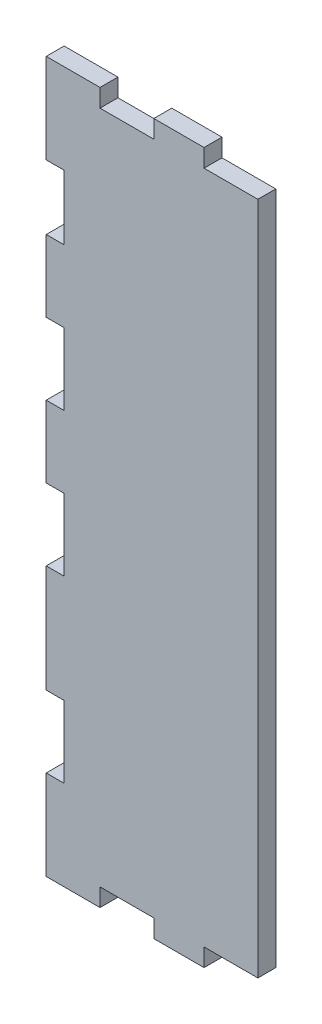
ISO-10303-21;
HEADER;
FILE_DESCRIPTION(('STEP AP214'),'2;1');
FILE_NAME('part.step','',(''),(''),'','','');
FILE_SCHEMA(('AUTOMOTIVE_DESIGN { 1 0 10303 214 1 1 1 1 }'));
ENDSEC;
DATA;
#1=APPLICATION_CONTEXT('core data for automotive mechanical design processes');
#2=APPLICATION_PROTOCOL_DEFINITION('international standard','automotive_design',2000,#1);
#3=PRODUCT_CONTEXT('',#1,'mechanical');
#4=PRODUCT('Part','Part','',(#3));
#5=PRODUCT_RELATED_PRODUCT_CATEGORY('part','',(#4));
#6=PRODUCT_DEFINITION_FORMATION('','',#4);
#7=PRODUCT_DEFINITION_CONTEXT('part definition',#1,'design');
#8=PRODUCT_DEFINITION('design','',#6,#7);
#9=PRODUCT_DEFINITION_SHAPE('','',#8);
#10=(LENGTH_UNIT() NAMED_UNIT(*) SI_UNIT(.MILLI.,.METRE.));
#11=(NAMED_UNIT(*) PLANE_ANGLE_UNIT() SI_UNIT($,.RADIAN.));
#12=(NAMED_UNIT(*) SI_UNIT($,.STERADIAN.) SOLID_ANGLE_UNIT());
#13=UNCERTAINTY_MEASURE_WITH_UNIT(LENGTH_MEASURE(1.E-05),#10,'distance_accuracy_value','');
#14=(GEOMETRIC_REPRESENTATION_CONTEXT(3) GLOBAL_UNCERTAINTY_ASSIGNED_CONTEXT((#13)) GLOBAL_UNIT_ASSIGNED_CONTEXT((#10,
#11,#12)) REPRESENTATION_CONTEXT('',''));
#15=CARTESIAN_POINT('',(0.,0.,0.));
#16=DIRECTION('',(0.,0.,1.));
#17=DIRECTION('',(1.,0.,0.));
#18=AXIS2_PLACEMENT_3D('',#15,#16,#17);
#19=CARTESIAN_POINT('',(-74.93,1.26999999999999,6.35));
#20=DIRECTION('',(1.,0.,0.));
#21=DIRECTION('',(0.,0.,-1.));
#22=AXIS2_PLACEMENT_3D('',#19,#20,#21);
#23=PLANE('',#22);
#24=DIRECTION('',(0.,1.,0.));
#25=VECTOR('',#24,1.);
#26=CARTESIAN_POINT('',(-74.93,1.26999999999999,0.));
#27=LINE('',#26,#25);
#28=CARTESIAN_POINT('',(-74.93,58.42,0.));
#29=VERTEX_POINT('',#28);
#30=CARTESIAN_POINT('',(-74.93,96.52,0.));
#31=VERTEX_POINT('',#30);
#32=EDGE_CURVE('E411',#29,#31,#27,.T.);
#33=ORIENTED_EDGE('',*,*,#32,.F.);
#34=DIRECTION('',(0.,0.,1.));
#35=VECTOR('',#34,1.);
#36=CARTESIAN_POINT('',(-74.93,58.42,0.));
#37=LINE('',#36,#35);
#38=CARTESIAN_POINT('',(-74.93,58.42,6.35));
#39=VERTEX_POINT('',#38);
#40=EDGE_CURVE('E281',#29,#39,#37,.T.);
#41=ORIENTED_EDGE('',*,*,#40,.T.);
#42=DIRECTION('',(0.,1.,0.));
#43=VECTOR('',#42,1.);
#44=CARTESIAN_POINT('',(-74.93,1.26999999999999,6.35));
#45=LINE('',#44,#43);
#46=CARTESIAN_POINT('',(-74.93,96.52,6.35));
#47=VERTEX_POINT('',#46);
#48=EDGE_CURVE('E416',#39,#47,#45,.T.);
#49=ORIENTED_EDGE('',*,*,#48,.T.);
#50=DIRECTION('',(0.,0.,1.));
#51=VECTOR('',#50,1.);
#52=CARTESIAN_POINT('',(-74.93,96.52,0.));
#53=LINE('',#52,#51);
#54=EDGE_CURVE('E287',#31,#47,#53,.T.);
#55=ORIENTED_EDGE('',*,*,#54,.F.);
#56=EDGE_LOOP('',(#33,#41,#49,#55));
#57=FACE_BOUND('',#56,.T.);
#58=ADVANCED_FACE('F36',(#57),#23,.F.);
#59=CARTESIAN_POINT('',(-74.93,121.92,0.));
#60=VERTEX_POINT('',#59);
#61=CARTESIAN_POINT('',(-74.93,147.32,0.));
#62=VERTEX_POINT('',#61);
#63=EDGE_CURVE('E537',#60,#62,#27,.T.);
#64=ORIENTED_EDGE('',*,*,#63,.F.);
#65=DIRECTION('',(0.,0.,1.));
#66=VECTOR('',#65,1.);
#67=CARTESIAN_POINT('',(-74.93,121.92,0.));
#68=LINE('',#67,#66);
#69=CARTESIAN_POINT('',(-74.93,121.92,6.35));
#70=VERTEX_POINT('',#69);
#71=EDGE_CURVE('E294',#60,#70,#68,.T.);
#72=ORIENTED_EDGE('',*,*,#71,.T.);
#73=CARTESIAN_POINT('',(-74.93,147.32,6.35));
#74=VERTEX_POINT('',#73);
#75=EDGE_CURVE('E559',#70,#74,#45,.T.);
#76=ORIENTED_EDGE('',*,*,#75,.T.);
#77=DIRECTION('',(0.,0.,1.));
#78=VECTOR('',#77,1.);
#79=CARTESIAN_POINT('',(-74.93,147.32,0.));
#80=LINE('',#79,#78);
#81=EDGE_CURVE('E313',#62,#74,#80,.T.);
#82=ORIENTED_EDGE('',*,*,#81,.F.);
#83=EDGE_LOOP('',(#64,#72,#76,#82));
#84=FACE_BOUND('',#83,.T.);
#85=ADVANCED_FACE('F521',(#84),#23,.F.);
#86=CARTESIAN_POINT('',(-74.93,172.72,0.));
#87=VERTEX_POINT('',#86);
#88=CARTESIAN_POINT('',(-74.93,198.12,0.));
#89=VERTEX_POINT('',#88);
#90=EDGE_CURVE('E535',#87,#89,#27,.T.);
#91=ORIENTED_EDGE('',*,*,#90,.F.);
#92=DIRECTION('',(0.,0.,1.));
#93=VECTOR('',#92,1.);
#94=CARTESIAN_POINT('',(-74.93,172.72,0.));
#95=LINE('',#94,#93);
#96=CARTESIAN_POINT('',(-74.93,172.72,6.35));
#97=VERTEX_POINT('',#96);
#98=EDGE_CURVE('E320',#87,#97,#95,.T.);
#99=ORIENTED_EDGE('',*,*,#98,.T.);
#100=CARTESIAN_POINT('',(-74.93,198.12,6.35));
#101=VERTEX_POINT('',#100);
#102=EDGE_CURVE('E571',#97,#101,#45,.T.);
#103=ORIENTED_EDGE('',*,*,#102,.T.);
#104=DIRECTION('',(0.,0.,1.));
#105=VECTOR('',#104,1.);
#106=CARTESIAN_POINT('',(-74.93,198.12,0.));
#107=LINE('',#106,#105);
#108=EDGE_CURVE('E337',#89,#101,#107,.T.);
#109=ORIENTED_EDGE('',*,*,#108,.F.);
#110=EDGE_LOOP('',(#91,#99,#103,#109));
#111=FACE_BOUND('',#110,.T.);
#112=ADVANCED_FACE('F525',(#111),#23,.F.);
#113=CARTESIAN_POINT('',(-74.93,220.98,0.));
#114=VERTEX_POINT('',#113);
#115=CARTESIAN_POINT('',(-74.93,252.73,0.));
#116=VERTEX_POINT('',#115);
#117=EDGE_CURVE('E412',#114,#116,#27,.T.);
#118=ORIENTED_EDGE('',*,*,#117,.F.);
#119=DIRECTION('',(0.,0.,1.));
#120=VECTOR('',#119,1.);
#121=CARTESIAN_POINT('',(-74.93,220.98,0.));
#122=LINE('',#121,#120);
#123=CARTESIAN_POINT('',(-74.93,220.98,6.35));
#124=VERTEX_POINT('',#123);
#125=EDGE_CURVE('E344',#114,#124,#122,.T.);
#126=ORIENTED_EDGE('',*,*,#125,.T.);
#127=CARTESIAN_POINT('',(-74.93,252.73,6.35));
#128=VERTEX_POINT('',#127);
#129=EDGE_CURVE('E406',#124,#128,#45,.T.);
#130=ORIENTED_EDGE('',*,*,#129,.T.);
#131=DIRECTION('',(0.,0.,-1.));
#132=VECTOR('',#131,1.);
#133=CARTESIAN_POINT('',(-74.93,252.73,6.35));
#134=LINE('',#133,#132);
#135=EDGE_CURVE('E380',#128,#116,#134,.T.);
#136=ORIENTED_EDGE('',*,*,#135,.T.);
#137=EDGE_LOOP('',(#118,#126,#130,#136));
#138=FACE_BOUND('',#137,.T.);
#139=ADVANCED_FACE('F508',(#138),#23,.F.);
#140=CARTESIAN_POINT('',(0.,1.27000000000005,6.35));
#141=DIRECTION('',(0.,1.,0.));
#142=DIRECTION('',(0.,0.,1.));
#143=AXIS2_PLACEMENT_3D('',#140,#141,#142);
#144=PLANE('',#143);
#145=DIRECTION('',(1.,0.,0.));
#146=VECTOR('',#145,1.);
#147=CARTESIAN_POINT('',(-76.2,1.27,6.35));
#148=LINE('',#147,#146);
#149=CARTESIAN_POINT('',(-36.83,1.27000000000005,6.35));
#150=VERTEX_POINT('',#149);
#151=CARTESIAN_POINT('',(-19.05,1.27000000000042,6.35));
#152=VERTEX_POINT('',#151);
#153=EDGE_CURVE('E45',#150,#152,#148,.T.);
#154=ORIENTED_EDGE('',*,*,#153,.F.);
#155=DIRECTION('',(0.,0.,1.));
#156=VECTOR('',#155,1.);
#157=CARTESIAN_POINT('',(-36.83,1.27000000000005,6.35));
#158=LINE('',#157,#156);
#159=CARTESIAN_POINT('',(-36.83,1.27000000000005,0.));
#160=VERTEX_POINT('',#159);
#161=EDGE_CURVE('E374',#160,#150,#158,.T.);
#162=ORIENTED_EDGE('',*,*,#161,.F.);
#163=DIRECTION('',(1.,0.,0.));
#164=VECTOR('',#163,1.);
#165=CARTESIAN_POINT('',(0.,1.27000000000005,0.));
#166=LINE('',#165,#164);
#167=CARTESIAN_POINT('',(-19.05,1.27000000000005,0.));
#168=VERTEX_POINT('',#167);
#169=EDGE_CURVE('E476',#160,#168,#166,.T.);
#170=ORIENTED_EDGE('',*,*,#169,.T.);
#171=DIRECTION('',(0.,0.,-1.));
#172=VECTOR('',#171,1.);
#173=CARTESIAN_POINT('',(-19.05,1.27000000000005,6.35));
#174=LINE('',#173,#172);
#175=EDGE_CURVE('E376',#152,#168,#174,.T.);
#176=ORIENTED_EDGE('',*,*,#175,.F.);
#177=EDGE_LOOP('',(#154,#162,#170,#176));
#178=FACE_BOUND('',#177,.T.);
#179=ADVANCED_FACE('F524',(#178),#144,.F.);
#180=CARTESIAN_POINT('',(0.,1.27000000000005,6.35));
#181=DIRECTION('',(-1.,0.,0.));
#182=DIRECTION('',(0.,0.,1.));
#183=AXIS2_PLACEMENT_3D('',#180,#181,#182);
#184=PLANE('',#183);
#185=DIRECTION('',(0.,1.,0.));
#186=VECTOR('',#185,1.);
#187=CARTESIAN_POINT('',(0.,1.27000000000005,6.35));
#188=LINE('',#187,#186);
#189=CARTESIAN_POINT('',(0.,7.62000000000005,6.35));
#190=VERTEX_POINT('',#189);
#191=CARTESIAN_POINT('',(0.,246.38,6.35));
#192=VERTEX_POINT('',#191);
#193=EDGE_CURVE('E462',#190,#192,#188,.T.);
#194=ORIENTED_EDGE('',*,*,#193,.F.);
#195=DIRECTION('',(0.,0.,1.));
#196=VECTOR('',#195,1.);
#197=CARTESIAN_POINT('',(0.,7.62000000000005,6.35));
#198=LINE('',#197,#196);
#199=CARTESIAN_POINT('',(0.,7.62000000000005,0.));
#200=VERTEX_POINT('',#199);
#201=EDGE_CURVE('E394',#200,#190,#198,.T.);
#202=ORIENTED_EDGE('',*,*,#201,.F.);
#203=DIRECTION('',(0.,1.,0.));
#204=VECTOR('',#203,1.);
#205=CARTESIAN_POINT('',(0.,1.27000000000005,0.));
#206=LINE('',#205,#204);
#207=CARTESIAN_POINT('',(0.,246.38,0.));
#208=VERTEX_POINT('',#207);
#209=EDGE_CURVE('E437',#200,#208,#206,.T.);
#210=ORIENTED_EDGE('',*,*,#209,.T.);
#211=DIRECTION('',(0.,0.,-1.));
#212=VECTOR('',#211,1.);
#213=CARTESIAN_POINT('',(0.,246.38,0.));
#214=LINE('',#213,#212);
#215=EDGE_CURVE('E454',#192,#208,#214,.T.);
#216=ORIENTED_EDGE('',*,*,#215,.F.);
#217=EDGE_LOOP('',(#194,#202,#210,#216));
#218=FACE_BOUND('',#217,.T.);
#219=ADVANCED_FACE('F38',(#218),#184,.F.);
#220=CARTESIAN_POINT('',(-76.2,252.73,6.35));
#221=DIRECTION('',(0.,-1.,0.));
#222=DIRECTION('',(0.,0.,-1.));
#223=AXIS2_PLACEMENT_3D('',#220,#221,#222);
#224=PLANE('',#223);
#225=DIRECTION('',(0.,0.,1.));
#226=VECTOR('',#225,1.);
#227=CARTESIAN_POINT('',(-36.83,252.73,0.));
#228=LINE('',#227,#226);
#229=CARTESIAN_POINT('',(-36.83,252.73,0.));
#230=VERTEX_POINT('',#229);
#231=CARTESIAN_POINT('',(-36.83,252.73,6.35));
#232=VERTEX_POINT('',#231);
#233=EDGE_CURVE('E430',#230,#232,#228,.T.);
#234=ORIENTED_EDGE('',*,*,#233,.T.);
#235=DIRECTION('',(-1.,0.,0.));
#236=VECTOR('',#235,1.);
#237=CARTESIAN_POINT('',(0.,252.73,6.35));
#238=LINE('',#237,#236);
#239=CARTESIAN_POINT('',(-19.05,252.73,6.35));
#240=VERTEX_POINT('',#239);
#241=EDGE_CURVE('E466',#240,#232,#238,.T.);
#242=ORIENTED_EDGE('',*,*,#241,.F.);
#243=DIRECTION('',(0.,0.,1.));
#244=VECTOR('',#243,1.);
#245=CARTESIAN_POINT('',(-19.05,252.73,0.));
#246=LINE('',#245,#244);
#247=CARTESIAN_POINT('',(-19.05,252.73,0.));
#248=VERTEX_POINT('',#247);
#249=EDGE_CURVE('E410',#248,#240,#246,.T.);
#250=ORIENTED_EDGE('',*,*,#249,.F.);
#251=DIRECTION('',(-1.,0.,0.));
#252=VECTOR('',#251,1.);
#253=CARTESIAN_POINT('',(-76.2,252.73,0.));
#254=LINE('',#253,#252);
#255=EDGE_CURVE('E470',#248,#230,#254,.T.);
#256=ORIENTED_EDGE('',*,*,#255,.T.);
#257=EDGE_LOOP('',(#234,#242,#250,#256));
#258=FACE_BOUND('',#257,.T.);
#259=ADVANCED_FACE('F618',(#258),#224,.F.);
#260=CARTESIAN_POINT('',(0.,0.,6.35));
#261=DIRECTION('',(0.,0.,1.));
#262=DIRECTION('',(1.,0.,0.));
#263=AXIS2_PLACEMENT_3D('',#260,#261,#262);
#264=PLANE('',#263);
#265=DIRECTION('',(-1.,0.,0.));
#266=VECTOR('',#265,1.);
#267=CARTESIAN_POINT('',(-74.93,58.42,6.35));
#268=LINE('',#267,#266);
#269=CARTESIAN_POINT('',(-68.58,58.42,6.35));
#270=VERTEX_POINT('',#269);
#271=EDGE_CURVE('E272',#270,#39,#268,.T.);
#272=ORIENTED_EDGE('',*,*,#271,.F.);
#273=DIRECTION('',(0.,1.,0.));
#274=VECTOR('',#273,1.);
#275=CARTESIAN_POINT('',(-68.58,33.02,6.35));
#276=LINE('',#275,#274);
#277=CARTESIAN_POINT('',(-68.58,33.02,6.35));
#278=VERTEX_POINT('',#277);
#279=EDGE_CURVE('E274',#278,#270,#276,.T.);
#280=ORIENTED_EDGE('',*,*,#279,.F.);
#281=DIRECTION('',(1.,0.,0.));
#282=VECTOR('',#281,1.);
#283=CARTESIAN_POINT('',(-74.93,33.02,6.35));
#284=LINE('',#283,#282);
#285=CARTESIAN_POINT('',(-74.93,33.02,6.35));
#286=VERTEX_POINT('',#285);
#287=EDGE_CURVE('E253',#286,#278,#284,.T.);
#288=ORIENTED_EDGE('',*,*,#287,.F.);
#289=CARTESIAN_POINT('',(-74.93,1.26999999999999,6.35));
#290=VERTEX_POINT('',#289);
#291=EDGE_CURVE('E413',#290,#286,#45,.T.);
#292=ORIENTED_EDGE('',*,*,#291,.F.);
#293=CARTESIAN_POINT('',(-55.88,1.27000000000015,6.35));
#294=VERTEX_POINT('',#293);
#295=EDGE_CURVE('E11',#290,#294,#148,.T.);
#296=ORIENTED_EDGE('',*,*,#295,.T.);
#297=DIRECTION('',(0.,-1.,0.));
#298=VECTOR('',#297,1.);
#299=CARTESIAN_POINT('',(-55.88,7.62000000000005,6.35));
#300=LINE('',#299,#298);
#301=CARTESIAN_POINT('',(-55.88,7.62000000000005,6.35));
#302=VERTEX_POINT('',#301);
#303=EDGE_CURVE('E384',#302,#294,#300,.T.);
#304=ORIENTED_EDGE('',*,*,#303,.F.);
#305=DIRECTION('',(-1.,0.,0.));
#306=VECTOR('',#305,1.);
#307=CARTESIAN_POINT('',(-36.83,7.62000000000005,6.35));
#308=LINE('',#307,#306);
#309=CARTESIAN_POINT('',(-36.83,7.62000000000005,6.35));
#310=VERTEX_POINT('',#309);
#311=EDGE_CURVE('E363',#310,#302,#308,.T.);
#312=ORIENTED_EDGE('',*,*,#311,.F.);
#313=DIRECTION('',(0.,-1.,0.));
#314=VECTOR('',#313,1.);
#315=CARTESIAN_POINT('',(-36.83,7.62000000000005,6.35));
#316=LINE('',#315,#314);
#317=EDGE_CURVE('E373',#310,#150,#316,.T.);
#318=ORIENTED_EDGE('',*,*,#317,.T.);
#319=ORIENTED_EDGE('',*,*,#153,.T.);
#320=DIRECTION('',(0.,-1.,0.));
#321=VECTOR('',#320,1.);
#322=CARTESIAN_POINT('',(-19.05,7.62000000000005,6.35));
#323=LINE('',#322,#321);
#324=CARTESIAN_POINT('',(-19.05,7.62000000000005,6.35));
#325=VERTEX_POINT('',#324);
#326=EDGE_CURVE('E388',#325,#152,#323,.T.);
#327=ORIENTED_EDGE('',*,*,#326,.F.);
#328=DIRECTION('',(-1.,0.,0.));
#329=VECTOR('',#328,1.);
#330=CARTESIAN_POINT('',(0.,7.62000000000005,6.35));
#331=LINE('',#330,#329);
#332=EDGE_CURVE('E399',#190,#325,#331,.T.);
#333=ORIENTED_EDGE('',*,*,#332,.F.);
#334=ORIENTED_EDGE('',*,*,#193,.T.);
#335=DIRECTION('',(1.,0.,0.));
#336=VECTOR('',#335,1.);
#337=CARTESIAN_POINT('',(0.,246.38,6.35));
#338=LINE('',#337,#336);
#339=CARTESIAN_POINT('',(-19.05,246.38,6.35));
#340=VERTEX_POINT('',#339);
#341=EDGE_CURVE('E451',#340,#192,#338,.T.);
#342=ORIENTED_EDGE('',*,*,#341,.F.);
#343=DIRECTION('',(0.,1.,0.));
#344=VECTOR('',#343,1.);
#345=CARTESIAN_POINT('',(-19.05,246.38,6.35));
#346=LINE('',#345,#344);
#347=EDGE_CURVE('E433',#340,#240,#346,.T.);
#348=ORIENTED_EDGE('',*,*,#347,.T.);
#349=ORIENTED_EDGE('',*,*,#241,.T.);
#350=DIRECTION('',(0.,1.,0.));
#351=VECTOR('',#350,1.);
#352=CARTESIAN_POINT('',(-36.83,246.38,6.35));
#353=LINE('',#352,#351);
#354=CARTESIAN_POINT('',(-36.83,246.38,6.35));
#355=VERTEX_POINT('',#354);
#356=EDGE_CURVE('E435',#355,#232,#353,.T.);
#357=ORIENTED_EDGE('',*,*,#356,.F.);
#358=DIRECTION('',(1.,0.,0.));
#359=VECTOR('',#358,1.);
#360=CARTESIAN_POINT('',(0.,246.38,6.35));
#361=LINE('',#360,#359);
#362=CARTESIAN_POINT('',(-55.88,246.38,6.35));
#363=VERTEX_POINT('',#362);
#364=EDGE_CURVE('E426',#363,#355,#361,.T.);
#365=ORIENTED_EDGE('',*,*,#364,.F.);
#366=DIRECTION('',(0.,1.,0.));
#367=VECTOR('',#366,1.);
#368=CARTESIAN_POINT('',(-55.88,246.38,6.35));
#369=LINE('',#368,#367);
#370=CARTESIAN_POINT('',(-55.88,252.73,6.35));
#371=VERTEX_POINT('',#370);
#372=EDGE_CURVE('E438',#363,#371,#369,.T.);
#373=ORIENTED_EDGE('',*,*,#372,.T.);
#374=EDGE_CURVE('E464',#371,#128,#238,.T.);
#375=ORIENTED_EDGE('',*,*,#374,.T.);
#376=ORIENTED_EDGE('',*,*,#129,.F.);
#377=DIRECTION('',(-1.,0.,0.));
#378=VECTOR('',#377,1.);
#379=CARTESIAN_POINT('',(-74.93,220.98,6.35));
#380=LINE('',#379,#378);
#381=CARTESIAN_POINT('',(-68.58,220.98,6.35));
#382=VERTEX_POINT('',#381);
#383=EDGE_CURVE('E347',#382,#124,#380,.T.);
#384=ORIENTED_EDGE('',*,*,#383,.F.);
#385=DIRECTION('',(0.,1.,0.));
#386=VECTOR('',#385,1.);
#387=CARTESIAN_POINT('',(-68.58,198.12,6.35));
#388=LINE('',#387,#386);
#389=CARTESIAN_POINT('',(-68.58,198.12,6.35));
#390=VERTEX_POINT('',#389);
#391=EDGE_CURVE('E349',#390,#382,#388,.T.);
#392=ORIENTED_EDGE('',*,*,#391,.F.);
#393=DIRECTION('',(1.,0.,0.));
#394=VECTOR('',#393,1.);
#395=CARTESIAN_POINT('',(-74.93,198.12,6.35));
#396=LINE('',#395,#394);
#397=EDGE_CURVE('E323',#101,#390,#396,.T.);
#398=ORIENTED_EDGE('',*,*,#397,.F.);
#399=ORIENTED_EDGE('',*,*,#102,.F.);
#400=DIRECTION('',(-1.,0.,0.));
#401=VECTOR('',#400,1.);
#402=CARTESIAN_POINT('',(-74.93,172.72,6.35));
#403=LINE('',#402,#401);
#404=CARTESIAN_POINT('',(-68.58,172.72,6.35));
#405=VERTEX_POINT('',#404);
#406=EDGE_CURVE('E324',#405,#97,#403,.T.);
#407=ORIENTED_EDGE('',*,*,#406,.F.);
#408=DIRECTION('',(0.,1.,0.));
#409=VECTOR('',#408,1.);
#410=CARTESIAN_POINT('',(-68.58,147.32,6.35));
#411=LINE('',#410,#409);
#412=CARTESIAN_POINT('',(-68.58,147.32,6.35));
#413=VERTEX_POINT('',#412);
#414=EDGE_CURVE('E326',#413,#405,#411,.T.);
#415=ORIENTED_EDGE('',*,*,#414,.F.);
#416=DIRECTION('',(1.,0.,0.));
#417=VECTOR('',#416,1.);
#418=CARTESIAN_POINT('',(-74.93,147.32,6.35));
#419=LINE('',#418,#417);
#420=EDGE_CURVE('E297',#74,#413,#419,.T.);
#421=ORIENTED_EDGE('',*,*,#420,.F.);
#422=ORIENTED_EDGE('',*,*,#75,.F.);
#423=DIRECTION('',(-1.,0.,0.));
#424=VECTOR('',#423,1.);
#425=CARTESIAN_POINT('',(-74.93,121.92,6.35));
#426=LINE('',#425,#424);
#427=CARTESIAN_POINT('',(-68.58,121.92,6.35));
#428=VERTEX_POINT('',#427);
#429=EDGE_CURVE('E298',#428,#70,#426,.T.);
#430=ORIENTED_EDGE('',*,*,#429,.F.);
#431=DIRECTION('',(0.,1.,0.));
#432=VECTOR('',#431,1.);
#433=CARTESIAN_POINT('',(-68.58,96.52,6.35));
#434=LINE('',#433,#432);
#435=CARTESIAN_POINT('',(-68.58,96.52,6.35));
#436=VERTEX_POINT('',#435);
#437=EDGE_CURVE('E300',#436,#428,#434,.T.);
#438=ORIENTED_EDGE('',*,*,#437,.F.);
#439=DIRECTION('',(1.,0.,0.));
#440=VECTOR('',#439,1.);
#441=CARTESIAN_POINT('',(-74.93,96.52,6.35));
#442=LINE('',#441,#440);
#443=EDGE_CURVE('E279',#47,#436,#442,.T.);
#444=ORIENTED_EDGE('',*,*,#443,.F.);
#445=ORIENTED_EDGE('',*,*,#48,.F.);
#446=EDGE_LOOP('',(#272,#280,#288,#292,#296,#304,#312,#318,#319,#327,#333,#334,#342,#348,#349,
#357,#365,#373,#375,#376,#384,#392,#398,#399,#407,#415,#421,#422,#430,#438,#444,#445));
#447=FACE_BOUND('',#446,.T.);
#448=ADVANCED_FACE('F500',(#447),#264,.T.);
#449=CARTESIAN_POINT('',(0.,0.,0.));
#450=DIRECTION('',(0.,0.,1.));
#451=DIRECTION('',(1.,0.,0.));
#452=AXIS2_PLACEMENT_3D('',#449,#450,#451);
#453=PLANE('',#452);
#454=DIRECTION('',(0.,1.,0.));
#455=VECTOR('',#454,1.);
#456=CARTESIAN_POINT('',(-68.58,33.02,0.));
#457=LINE('',#456,#455);
#458=CARTESIAN_POINT('',(-68.58,33.02,0.));
#459=VERTEX_POINT('',#458);
#460=CARTESIAN_POINT('',(-68.58,58.42,0.));
#461=VERTEX_POINT('',#460);
#462=EDGE_CURVE('E261',#459,#461,#457,.T.);
#463=ORIENTED_EDGE('',*,*,#462,.T.);
#464=DIRECTION('',(-1.,0.,0.));
#465=VECTOR('',#464,1.);
#466=CARTESIAN_POINT('',(-74.93,58.42,0.));
#467=LINE('',#466,#465);
#468=EDGE_CURVE('E266',#461,#29,#467,.T.);
#469=ORIENTED_EDGE('',*,*,#468,.T.);
#470=ORIENTED_EDGE('',*,*,#32,.T.);
#471=DIRECTION('',(1.,0.,0.));
#472=VECTOR('',#471,1.);
#473=CARTESIAN_POINT('',(-74.93,96.52,0.));
#474=LINE('',#473,#472);
#475=CARTESIAN_POINT('',(-68.58,96.52,0.));
#476=VERTEX_POINT('',#475);
#477=EDGE_CURVE('E301',#31,#476,#474,.T.);
#478=ORIENTED_EDGE('',*,*,#477,.T.);
#479=DIRECTION('',(0.,1.,0.));
#480=VECTOR('',#479,1.);
#481=CARTESIAN_POINT('',(-68.58,96.52,0.));
#482=LINE('',#481,#480);
#483=CARTESIAN_POINT('',(-68.58,121.92,0.));
#484=VERTEX_POINT('',#483);
#485=EDGE_CURVE('E308',#476,#484,#482,.T.);
#486=ORIENTED_EDGE('',*,*,#485,.T.);
#487=DIRECTION('',(-1.,0.,0.));
#488=VECTOR('',#487,1.);
#489=CARTESIAN_POINT('',(-74.93,121.92,0.));
#490=LINE('',#489,#488);
#491=EDGE_CURVE('E289',#484,#60,#490,.T.);
#492=ORIENTED_EDGE('',*,*,#491,.T.);
#493=ORIENTED_EDGE('',*,*,#63,.T.);
#494=DIRECTION('',(1.,0.,0.));
#495=VECTOR('',#494,1.);
#496=CARTESIAN_POINT('',(-74.93,147.32,0.));
#497=LINE('',#496,#495);
#498=CARTESIAN_POINT('',(-68.58,147.32,0.));
#499=VERTEX_POINT('',#498);
#500=EDGE_CURVE('E61',#62,#499,#497,.T.);
#501=ORIENTED_EDGE('',*,*,#500,.T.);
#502=DIRECTION('',(0.,1.,0.));
#503=VECTOR('',#502,1.);
#504=CARTESIAN_POINT('',(-68.58,147.32,0.));
#505=LINE('',#504,#503);
#506=CARTESIAN_POINT('',(-68.58,172.72,0.));
#507=VERTEX_POINT('',#506);
#508=EDGE_CURVE('E333',#499,#507,#505,.T.);
#509=ORIENTED_EDGE('',*,*,#508,.T.);
#510=DIRECTION('',(-1.,0.,0.));
#511=VECTOR('',#510,1.);
#512=CARTESIAN_POINT('',(-74.93,172.72,0.));
#513=LINE('',#512,#511);
#514=EDGE_CURVE('E315',#507,#87,#513,.T.);
#515=ORIENTED_EDGE('',*,*,#514,.T.);
#516=ORIENTED_EDGE('',*,*,#90,.T.);
#517=DIRECTION('',(1.,0.,0.));
#518=VECTOR('',#517,1.);
#519=CARTESIAN_POINT('',(-74.93,198.12,0.));
#520=LINE('',#519,#518);
#521=CARTESIAN_POINT('',(-68.58,198.12,0.));
#522=VERTEX_POINT('',#521);
#523=EDGE_CURVE('E53',#89,#522,#520,.T.);
#524=ORIENTED_EDGE('',*,*,#523,.T.);
#525=DIRECTION('',(0.,1.,0.));
#526=VECTOR('',#525,1.);
#527=CARTESIAN_POINT('',(-68.58,198.12,0.));
#528=LINE('',#527,#526);
#529=CARTESIAN_POINT('',(-68.58,220.98,0.));
#530=VERTEX_POINT('',#529);
#531=EDGE_CURVE('E356',#522,#530,#528,.T.);
#532=ORIENTED_EDGE('',*,*,#531,.T.);
#533=DIRECTION('',(-1.,0.,0.));
#534=VECTOR('',#533,1.);
#535=CARTESIAN_POINT('',(-74.93,220.98,0.));
#536=LINE('',#535,#534);
#537=EDGE_CURVE('E339',#530,#114,#536,.T.);
#538=ORIENTED_EDGE('',*,*,#537,.T.);
#539=ORIENTED_EDGE('',*,*,#117,.T.);
#540=CARTESIAN_POINT('',(-55.88,252.73,0.));
#541=VERTEX_POINT('',#540);
#542=EDGE_CURVE('E468',#541,#116,#254,.T.);
#543=ORIENTED_EDGE('',*,*,#542,.F.);
#544=DIRECTION('',(0.,1.,0.));
#545=VECTOR('',#544,1.);
#546=CARTESIAN_POINT('',(-55.88,246.38,0.));
#547=LINE('',#546,#545);
#548=CARTESIAN_POINT('',(-55.88,246.38,0.));
#549=VERTEX_POINT('',#548);
#550=EDGE_CURVE('E441',#549,#541,#547,.T.);
#551=ORIENTED_EDGE('',*,*,#550,.F.);
#552=DIRECTION('',(-1.,0.,0.));
#553=VECTOR('',#552,1.);
#554=CARTESIAN_POINT('',(0.,246.38,0.));
#555=LINE('',#554,#553);
#556=CARTESIAN_POINT('',(-36.83,246.38,0.));
#557=VERTEX_POINT('',#556);
#558=EDGE_CURVE('E419',#557,#549,#555,.T.);
#559=ORIENTED_EDGE('',*,*,#558,.F.);
#560=DIRECTION('',(0.,1.,0.));
#561=VECTOR('',#560,1.);
#562=CARTESIAN_POINT('',(-36.83,246.38,0.));
#563=LINE('',#562,#561);
#564=EDGE_CURVE('E429',#557,#230,#563,.T.);
#565=ORIENTED_EDGE('',*,*,#564,.T.);
#566=ORIENTED_EDGE('',*,*,#255,.F.);
#567=DIRECTION('',(0.,1.,0.));
#568=VECTOR('',#567,1.);
#569=CARTESIAN_POINT('',(-19.05,246.38,0.));
#570=LINE('',#569,#568);
#571=CARTESIAN_POINT('',(-19.05,246.38,0.));
#572=VERTEX_POINT('',#571);
#573=EDGE_CURVE('E457',#572,#248,#570,.T.);
#574=ORIENTED_EDGE('',*,*,#573,.F.);
#575=DIRECTION('',(-1.,0.,0.));
#576=VECTOR('',#575,1.);
#577=CARTESIAN_POINT('',(0.,246.38,0.));
#578=LINE('',#577,#576);
#579=EDGE_CURVE('E445',#208,#572,#578,.T.);
#580=ORIENTED_EDGE('',*,*,#579,.F.);
#581=ORIENTED_EDGE('',*,*,#209,.F.);
#582=DIRECTION('',(1.,0.,0.));
#583=VECTOR('',#582,1.);
#584=CARTESIAN_POINT('',(0.,7.62000000000005,0.));
#585=LINE('',#584,#583);
#586=CARTESIAN_POINT('',(-19.05,7.62000000000005,0.));
#587=VERTEX_POINT('',#586);
#588=EDGE_CURVE('E390',#587,#200,#585,.T.);
#589=ORIENTED_EDGE('',*,*,#588,.F.);
#590=DIRECTION('',(0.,-1.,0.));
#591=VECTOR('',#590,1.);
#592=CARTESIAN_POINT('',(-19.05,7.62000000000005,0.));
#593=LINE('',#592,#591);
#594=EDGE_CURVE('E284',#587,#168,#593,.T.);
#595=ORIENTED_EDGE('',*,*,#594,.T.);
#596=ORIENTED_EDGE('',*,*,#169,.F.);
#597=DIRECTION('',(0.,-1.,0.));
#598=VECTOR('',#597,1.);
#599=CARTESIAN_POINT('',(-36.83,7.62000000000005,0.));
#600=LINE('',#599,#598);
#601=CARTESIAN_POINT('',(-36.83,7.62000000000005,0.));
#602=VERTEX_POINT('',#601);
#603=EDGE_CURVE('E378',#602,#160,#600,.T.);
#604=ORIENTED_EDGE('',*,*,#603,.F.);
#605=DIRECTION('',(1.,0.,0.));
#606=VECTOR('',#605,1.);
#607=CARTESIAN_POINT('',(-36.83,7.62000000000005,0.));
#608=LINE('',#607,#606);
#609=CARTESIAN_POINT('',(-55.88,7.62000000000005,0.));
#610=VERTEX_POINT('',#609);
#611=EDGE_CURVE('E370',#610,#602,#608,.T.);
#612=ORIENTED_EDGE('',*,*,#611,.F.);
#613=DIRECTION('',(0.,-1.,0.));
#614=VECTOR('',#613,1.);
#615=CARTESIAN_POINT('',(-55.88,7.62000000000005,0.));
#616=LINE('',#615,#614);
#617=CARTESIAN_POINT('',(-55.88,1.27000000000005,0.));
#618=VERTEX_POINT('',#617);
#619=EDGE_CURVE('E381',#610,#618,#616,.T.);
#620=ORIENTED_EDGE('',*,*,#619,.T.);
#621=CARTESIAN_POINT('',(-74.93,1.27000000000005,0.));
#622=VERTEX_POINT('',#621);
#623=EDGE_CURVE('E40',#622,#618,#166,.T.);
#624=ORIENTED_EDGE('',*,*,#623,.F.);
#625=CARTESIAN_POINT('',(-74.93,33.02,0.));
#626=VERTEX_POINT('',#625);
#627=EDGE_CURVE('E271',#622,#626,#27,.T.);
#628=ORIENTED_EDGE('',*,*,#627,.T.);
#629=DIRECTION('',(1.,0.,0.));
#630=VECTOR('',#629,1.);
#631=CARTESIAN_POINT('',(-74.93,33.02,0.));
#632=LINE('',#631,#630);
#633=EDGE_CURVE('E250',#626,#459,#632,.T.);
#634=ORIENTED_EDGE('',*,*,#633,.T.);
#635=EDGE_LOOP('',(#463,#469,#470,#478,#486,#492,#493,#501,#509,#515,#516,#524,#532,#538,#539,
#543,#551,#559,#565,#566,#574,#580,#581,#589,#595,#596,#604,#612,#620,#624,#628,#634));
#636=FACE_BOUND('',#635,.T.);
#637=ADVANCED_FACE('F269',(#636),#453,.F.);
#638=ORIENTED_EDGE('',*,*,#542,.T.);
#639=ORIENTED_EDGE('',*,*,#135,.F.);
#640=ORIENTED_EDGE('',*,*,#374,.F.);
#641=DIRECTION('',(0.,0.,1.));
#642=VECTOR('',#641,1.);
#643=CARTESIAN_POINT('',(-55.88,252.73,0.));
#644=LINE('',#643,#642);
#645=EDGE_CURVE('E420',#541,#371,#644,.T.);
#646=ORIENTED_EDGE('',*,*,#645,.F.);
#647=EDGE_LOOP('',(#638,#639,#640,#646));
#648=FACE_BOUND('',#647,.T.);
#649=ADVANCED_FACE('F630',(#648),#224,.F.);
#650=ORIENTED_EDGE('',*,*,#623,.T.);
#651=DIRECTION('',(0.,0.,-1.));
#652=VECTOR('',#651,1.);
#653=CARTESIAN_POINT('',(-55.88,1.27000000000005,6.35));
#654=LINE('',#653,#652);
#655=EDGE_CURVE('E364',#294,#618,#654,.T.);
#656=ORIENTED_EDGE('',*,*,#655,.F.);
#657=ORIENTED_EDGE('',*,*,#295,.F.);
#658=DIRECTION('',(0.,0.,-1.));
#659=VECTOR('',#658,1.);
#660=CARTESIAN_POINT('',(-74.93,1.26999999999999,6.35));
#661=LINE('',#660,#659);
#662=EDGE_CURVE('E403',#290,#622,#661,.T.);
#663=ORIENTED_EDGE('',*,*,#662,.T.);
#664=EDGE_LOOP('',(#650,#656,#657,#663));
#665=FACE_BOUND('',#664,.T.);
#666=ADVANCED_FACE('F488',(#665),#144,.F.);
#667=CARTESIAN_POINT('',(-19.05,246.38,0.));
#668=DIRECTION('',(-1.,0.,0.));
#669=DIRECTION('',(0.,0.,1.));
#670=AXIS2_PLACEMENT_3D('',#667,#668,#669);
#671=PLANE('',#670);
#672=ORIENTED_EDGE('',*,*,#249,.T.);
#673=ORIENTED_EDGE('',*,*,#347,.F.);
#674=DIRECTION('',(0.,0.,1.));
#675=VECTOR('',#674,1.);
#676=CARTESIAN_POINT('',(-19.05,246.38,0.));
#677=LINE('',#676,#675);
#678=EDGE_CURVE('E448',#572,#340,#677,.T.);
#679=ORIENTED_EDGE('',*,*,#678,.F.);
#680=ORIENTED_EDGE('',*,*,#573,.T.);
#681=EDGE_LOOP('',(#672,#673,#679,#680));
#682=FACE_BOUND('',#681,.T.);
#683=ADVANCED_FACE('F616',(#682),#671,.F.);
#684=CARTESIAN_POINT('',(0.,246.38,0.));
#685=DIRECTION('',(0.,1.,0.));
#686=DIRECTION('',(0.,0.,1.));
#687=AXIS2_PLACEMENT_3D('',#684,#685,#686);
#688=PLANE('',#687);
#689=ORIENTED_EDGE('',*,*,#579,.T.);
#690=ORIENTED_EDGE('',*,*,#678,.T.);
#691=ORIENTED_EDGE('',*,*,#341,.T.);
#692=ORIENTED_EDGE('',*,*,#215,.T.);
#693=EDGE_LOOP('',(#689,#690,#691,#692));
#694=FACE_BOUND('',#693,.T.);
#695=ADVANCED_FACE('F613',(#694),#688,.T.);
#696=CARTESIAN_POINT('',(-36.83,246.38,0.));
#697=DIRECTION('',(-1.,0.,0.));
#698=DIRECTION('',(0.,0.,1.));
#699=AXIS2_PLACEMENT_3D('',#696,#697,#698);
#700=PLANE('',#699);
#701=ORIENTED_EDGE('',*,*,#233,.F.);
#702=ORIENTED_EDGE('',*,*,#564,.F.);
#703=DIRECTION('',(0.,0.,1.));
#704=VECTOR('',#703,1.);
#705=CARTESIAN_POINT('',(-36.83,246.38,0.));
#706=LINE('',#705,#704);
#707=EDGE_CURVE('E417',#557,#355,#706,.T.);
#708=ORIENTED_EDGE('',*,*,#707,.T.);
#709=ORIENTED_EDGE('',*,*,#356,.T.);
#710=EDGE_LOOP('',(#701,#702,#708,#709));
#711=FACE_BOUND('',#710,.T.);
#712=ADVANCED_FACE('F624',(#711),#700,.T.);
#713=CARTESIAN_POINT('',(-55.88,246.38,0.));
#714=DIRECTION('',(-1.,0.,0.));
#715=DIRECTION('',(0.,0.,1.));
#716=AXIS2_PLACEMENT_3D('',#713,#714,#715);
#717=PLANE('',#716);
#718=ORIENTED_EDGE('',*,*,#645,.T.);
#719=ORIENTED_EDGE('',*,*,#372,.F.);
#720=DIRECTION('',(0.,0.,1.));
#721=VECTOR('',#720,1.);
#722=CARTESIAN_POINT('',(-55.88,246.38,0.));
#723=LINE('',#722,#721);
#724=EDGE_CURVE('E423',#549,#363,#723,.T.);
#725=ORIENTED_EDGE('',*,*,#724,.F.);
#726=ORIENTED_EDGE('',*,*,#550,.T.);
#727=EDGE_LOOP('',(#718,#719,#725,#726));
#728=FACE_BOUND('',#727,.T.);
#729=ADVANCED_FACE('F516',(#728),#717,.F.);
#730=CARTESIAN_POINT('',(0.,246.38,0.));
#731=DIRECTION('',(0.,1.,0.));
#732=DIRECTION('',(0.,0.,1.));
#733=AXIS2_PLACEMENT_3D('',#730,#731,#732);
#734=PLANE('',#733);
#735=ORIENTED_EDGE('',*,*,#707,.F.);
#736=ORIENTED_EDGE('',*,*,#558,.T.);
#737=ORIENTED_EDGE('',*,*,#724,.T.);
#738=ORIENTED_EDGE('',*,*,#364,.T.);
#739=EDGE_LOOP('',(#735,#736,#737,#738));
#740=FACE_BOUND('',#739,.T.);
#741=ADVANCED_FACE('F506',(#740),#734,.T.);
#742=ORIENTED_EDGE('',*,*,#291,.T.);
#743=DIRECTION('',(0.,0.,1.));
#744=VECTOR('',#743,1.);
#745=CARTESIAN_POINT('',(-74.93,33.02,0.));
#746=LINE('',#745,#744);
#747=EDGE_CURVE('E258',#626,#286,#746,.T.);
#748=ORIENTED_EDGE('',*,*,#747,.F.);
#749=ORIENTED_EDGE('',*,*,#627,.F.);
#750=ORIENTED_EDGE('',*,*,#662,.F.);
#751=EDGE_LOOP('',(#742,#748,#749,#750));
#752=FACE_BOUND('',#751,.T.);
#753=ADVANCED_FACE('F503',(#752),#23,.F.);
#754=CARTESIAN_POINT('',(-19.05,7.62000000000005,6.35));
#755=DIRECTION('',(-1.,0.,0.));
#756=DIRECTION('',(0.,0.,1.));
#757=AXIS2_PLACEMENT_3D('',#754,#755,#756);
#758=PLANE('',#757);
#759=ORIENTED_EDGE('',*,*,#175,.T.);
#760=ORIENTED_EDGE('',*,*,#594,.F.);
#761=DIRECTION('',(0.,0.,-1.));
#762=VECTOR('',#761,1.);
#763=CARTESIAN_POINT('',(-19.05,7.62000000000005,6.35));
#764=LINE('',#763,#762);
#765=EDGE_CURVE('E396',#325,#587,#764,.T.);
#766=ORIENTED_EDGE('',*,*,#765,.F.);
#767=ORIENTED_EDGE('',*,*,#326,.T.);
#768=EDGE_LOOP('',(#759,#760,#766,#767));
#769=FACE_BOUND('',#768,.T.);
#770=ADVANCED_FACE('F505',(#769),#758,.F.);
#771=CARTESIAN_POINT('',(0.,7.62000000000005,0.));
#772=DIRECTION('',(0.,1.,0.));
#773=DIRECTION('',(0.,0.,1.));
#774=AXIS2_PLACEMENT_3D('',#771,#772,#773);
#775=PLANE('',#774);
#776=ORIENTED_EDGE('',*,*,#201,.T.);
#777=ORIENTED_EDGE('',*,*,#332,.T.);
#778=ORIENTED_EDGE('',*,*,#765,.T.);
#779=ORIENTED_EDGE('',*,*,#588,.T.);
#780=EDGE_LOOP('',(#776,#777,#778,#779));
#781=FACE_BOUND('',#780,.T.);
#782=ADVANCED_FACE('F513',(#781),#775,.F.);
#783=CARTESIAN_POINT('',(-36.83,7.62000000000005,6.35));
#784=DIRECTION('',(1.,0.,0.));
#785=DIRECTION('',(0.,0.,-1.));
#786=AXIS2_PLACEMENT_3D('',#783,#784,#785);
#787=PLANE('',#786);
#788=ORIENTED_EDGE('',*,*,#161,.T.);
#789=ORIENTED_EDGE('',*,*,#317,.F.);
#790=DIRECTION('',(0.,0.,1.));
#791=VECTOR('',#790,1.);
#792=CARTESIAN_POINT('',(-36.83,7.62000000000005,6.35));
#793=LINE('',#792,#791);
#794=EDGE_CURVE('E360',#602,#310,#793,.T.);
#795=ORIENTED_EDGE('',*,*,#794,.F.);
#796=ORIENTED_EDGE('',*,*,#603,.T.);
#797=EDGE_LOOP('',(#788,#789,#795,#796));
#798=FACE_BOUND('',#797,.T.);
#799=ADVANCED_FACE('F594',(#798),#787,.F.);
#800=CARTESIAN_POINT('',(-55.88,7.62000000000005,6.35));
#801=DIRECTION('',(-1.,0.,0.));
#802=DIRECTION('',(0.,0.,1.));
#803=AXIS2_PLACEMENT_3D('',#800,#801,#802);
#804=PLANE('',#803);
#805=ORIENTED_EDGE('',*,*,#655,.T.);
#806=ORIENTED_EDGE('',*,*,#619,.F.);
#807=DIRECTION('',(0.,0.,-1.));
#808=VECTOR('',#807,1.);
#809=CARTESIAN_POINT('',(-55.88,7.62000000000005,6.35));
#810=LINE('',#809,#808);
#811=EDGE_CURVE('E367',#302,#610,#810,.T.);
#812=ORIENTED_EDGE('',*,*,#811,.F.);
#813=ORIENTED_EDGE('',*,*,#303,.T.);
#814=EDGE_LOOP('',(#805,#806,#812,#813));
#815=FACE_BOUND('',#814,.T.);
#816=ADVANCED_FACE('F493',(#815),#804,.F.);
#817=CARTESIAN_POINT('',(0.,7.62000000000005,0.));
#818=DIRECTION('',(0.,1.,0.));
#819=DIRECTION('',(0.,0.,1.));
#820=AXIS2_PLACEMENT_3D('',#817,#818,#819);
#821=PLANE('',#820);
#822=ORIENTED_EDGE('',*,*,#794,.T.);
#823=ORIENTED_EDGE('',*,*,#311,.T.);
#824=ORIENTED_EDGE('',*,*,#811,.T.);
#825=ORIENTED_EDGE('',*,*,#611,.T.);
#826=EDGE_LOOP('',(#822,#823,#824,#825));
#827=FACE_BOUND('',#826,.T.);
#828=ADVANCED_FACE('F495',(#827),#821,.F.);
#829=CARTESIAN_POINT('',(-74.93,220.98,0.));
#830=DIRECTION('',(0.,1.,0.));
#831=DIRECTION('',(0.,0.,1.));
#832=AXIS2_PLACEMENT_3D('',#829,#830,#831);
#833=PLANE('',#832);
#834=ORIENTED_EDGE('',*,*,#383,.T.);
#835=ORIENTED_EDGE('',*,*,#125,.F.);
#836=ORIENTED_EDGE('',*,*,#537,.F.);
#837=DIRECTION('',(0.,0.,1.));
#838=VECTOR('',#837,1.);
#839=CARTESIAN_POINT('',(-68.58,220.98,0.));
#840=LINE('',#839,#838);
#841=EDGE_CURVE('E342',#530,#382,#840,.T.);
#842=ORIENTED_EDGE('',*,*,#841,.T.);
#843=EDGE_LOOP('',(#834,#835,#836,#842));
#844=FACE_BOUND('',#843,.T.);
#845=ADVANCED_FACE('F581',(#844),#833,.F.);
#846=CARTESIAN_POINT('',(-68.58,198.12,0.));
#847=DIRECTION('',(1.,0.,0.));
#848=DIRECTION('',(0.,0.,-1.));
#849=AXIS2_PLACEMENT_3D('',#846,#847,#848);
#850=PLANE('',#849);
#851=ORIENTED_EDGE('',*,*,#391,.T.);
#852=ORIENTED_EDGE('',*,*,#841,.F.);
#853=ORIENTED_EDGE('',*,*,#531,.F.);
#854=DIRECTION('',(0.,0.,1.));
#855=VECTOR('',#854,1.);
#856=CARTESIAN_POINT('',(-68.58,198.12,0.));
#857=LINE('',#856,#855);
#858=EDGE_CURVE('E340',#522,#390,#857,.T.);
#859=ORIENTED_EDGE('',*,*,#858,.T.);
#860=EDGE_LOOP('',(#851,#852,#853,#859));
#861=FACE_BOUND('',#860,.T.);
#862=ADVANCED_FACE('F577',(#861),#850,.F.);
#863=CARTESIAN_POINT('',(-74.93,198.12,0.));
#864=DIRECTION('',(0.,-1.,0.));
#865=DIRECTION('',(0.,0.,-1.));
#866=AXIS2_PLACEMENT_3D('',#863,#864,#865);
#867=PLANE('',#866);
#868=ORIENTED_EDGE('',*,*,#397,.T.);
#869=ORIENTED_EDGE('',*,*,#858,.F.);
#870=ORIENTED_EDGE('',*,*,#523,.F.);
#871=ORIENTED_EDGE('',*,*,#108,.T.);
#872=EDGE_LOOP('',(#868,#869,#870,#871));
#873=FACE_BOUND('',#872,.T.);
#874=ADVANCED_FACE('F573',(#873),#867,.F.);
#875=CARTESIAN_POINT('',(-74.93,172.72,0.));
#876=DIRECTION('',(0.,1.,0.));
#877=DIRECTION('',(0.,0.,1.));
#878=AXIS2_PLACEMENT_3D('',#875,#876,#877);
#879=PLANE('',#878);
#880=ORIENTED_EDGE('',*,*,#406,.T.);
#881=ORIENTED_EDGE('',*,*,#98,.F.);
#882=ORIENTED_EDGE('',*,*,#514,.F.);
#883=DIRECTION('',(0.,0.,1.));
#884=VECTOR('',#883,1.);
#885=CARTESIAN_POINT('',(-68.58,172.72,0.));
#886=LINE('',#885,#884);
#887=EDGE_CURVE('E318',#507,#405,#886,.T.);
#888=ORIENTED_EDGE('',*,*,#887,.T.);
#889=EDGE_LOOP('',(#880,#881,#882,#888));
#890=FACE_BOUND('',#889,.T.);
#891=ADVANCED_FACE('F813',(#890),#879,.F.);
#892=CARTESIAN_POINT('',(-68.58,147.32,0.));
#893=DIRECTION('',(1.,0.,0.));
#894=DIRECTION('',(0.,0.,-1.));
#895=AXIS2_PLACEMENT_3D('',#892,#893,#894);
#896=PLANE('',#895);
#897=ORIENTED_EDGE('',*,*,#414,.T.);
#898=ORIENTED_EDGE('',*,*,#887,.F.);
#899=ORIENTED_EDGE('',*,*,#508,.F.);
#900=DIRECTION('',(0.,0.,1.));
#901=VECTOR('',#900,1.);
#902=CARTESIAN_POINT('',(-68.58,147.32,0.));
#903=LINE('',#902,#901);
#904=EDGE_CURVE('E316',#499,#413,#903,.T.);
#905=ORIENTED_EDGE('',*,*,#904,.T.);
#906=EDGE_LOOP('',(#897,#898,#899,#905));
#907=FACE_BOUND('',#906,.T.);
#908=ADVANCED_FACE('F566',(#907),#896,.F.);
#909=CARTESIAN_POINT('',(-74.93,147.32,0.));
#910=DIRECTION('',(0.,-1.,0.));
#911=DIRECTION('',(0.,0.,-1.));
#912=AXIS2_PLACEMENT_3D('',#909,#910,#911);
#913=PLANE('',#912);
#914=ORIENTED_EDGE('',*,*,#420,.T.);
#915=ORIENTED_EDGE('',*,*,#904,.F.);
#916=ORIENTED_EDGE('',*,*,#500,.F.);
#917=ORIENTED_EDGE('',*,*,#81,.T.);
#918=EDGE_LOOP('',(#914,#915,#916,#917));
#919=FACE_BOUND('',#918,.T.);
#920=ADVANCED_FACE('F561',(#919),#913,.F.);
#921=CARTESIAN_POINT('',(-74.93,121.92,0.));
#922=DIRECTION('',(0.,1.,0.));
#923=DIRECTION('',(0.,0.,1.));
#924=AXIS2_PLACEMENT_3D('',#921,#922,#923);
#925=PLANE('',#924);
#926=ORIENTED_EDGE('',*,*,#429,.T.);
#927=ORIENTED_EDGE('',*,*,#71,.F.);
#928=ORIENTED_EDGE('',*,*,#491,.F.);
#929=DIRECTION('',(0.,0.,1.));
#930=VECTOR('',#929,1.);
#931=CARTESIAN_POINT('',(-68.58,121.92,0.));
#932=LINE('',#931,#930);
#933=EDGE_CURVE('E292',#484,#428,#932,.T.);
#934=ORIENTED_EDGE('',*,*,#933,.T.);
#935=EDGE_LOOP('',(#926,#927,#928,#934));
#936=FACE_BOUND('',#935,.T.);
#937=ADVANCED_FACE('F840',(#936),#925,.F.);
#938=CARTESIAN_POINT('',(-68.58,96.52,0.));
#939=DIRECTION('',(1.,0.,0.));
#940=DIRECTION('',(0.,0.,-1.));
#941=AXIS2_PLACEMENT_3D('',#938,#939,#940);
#942=PLANE('',#941);
#943=ORIENTED_EDGE('',*,*,#437,.T.);
#944=ORIENTED_EDGE('',*,*,#933,.F.);
#945=ORIENTED_EDGE('',*,*,#485,.F.);
#946=DIRECTION('',(0.,0.,1.));
#947=VECTOR('',#946,1.);
#948=CARTESIAN_POINT('',(-68.58,96.52,0.));
#949=LINE('',#948,#947);
#950=EDGE_CURVE('E290',#476,#436,#949,.T.);
#951=ORIENTED_EDGE('',*,*,#950,.T.);
#952=EDGE_LOOP('',(#943,#944,#945,#951));
#953=FACE_BOUND('',#952,.T.);
#954=ADVANCED_FACE('F553',(#953),#942,.F.);
#955=CARTESIAN_POINT('',(-74.93,96.52,0.));
#956=DIRECTION('',(0.,-1.,0.));
#957=DIRECTION('',(0.,0.,-1.));
#958=AXIS2_PLACEMENT_3D('',#955,#956,#957);
#959=PLANE('',#958);
#960=ORIENTED_EDGE('',*,*,#443,.T.);
#961=ORIENTED_EDGE('',*,*,#950,.F.);
#962=ORIENTED_EDGE('',*,*,#477,.F.);
#963=ORIENTED_EDGE('',*,*,#54,.T.);
#964=EDGE_LOOP('',(#960,#961,#962,#963));
#965=FACE_BOUND('',#964,.T.);
#966=ADVANCED_FACE('F548',(#965),#959,.F.);
#967=CARTESIAN_POINT('',(-74.93,58.42,0.));
#968=DIRECTION('',(0.,1.,0.));
#969=DIRECTION('',(0.,0.,1.));
#970=AXIS2_PLACEMENT_3D('',#967,#968,#969);
#971=PLANE('',#970);
#972=ORIENTED_EDGE('',*,*,#271,.T.);
#973=ORIENTED_EDGE('',*,*,#40,.F.);
#974=ORIENTED_EDGE('',*,*,#468,.F.);
#975=DIRECTION('',(0.,0.,1.));
#976=VECTOR('',#975,1.);
#977=CARTESIAN_POINT('',(-68.58,58.42,0.));
#978=LINE('',#977,#976);
#979=EDGE_CURVE('E257',#461,#270,#978,.T.);
#980=ORIENTED_EDGE('',*,*,#979,.T.);
#981=EDGE_LOOP('',(#972,#973,#974,#980));
#982=FACE_BOUND('',#981,.T.);
#983=ADVANCED_FACE('F868',(#982),#971,.F.);
#984=CARTESIAN_POINT('',(-68.58,33.02,0.));
#985=DIRECTION('',(1.,0.,0.));
#986=DIRECTION('',(0.,0.,-1.));
#987=AXIS2_PLACEMENT_3D('',#984,#985,#986);
#988=PLANE('',#987);
#989=ORIENTED_EDGE('',*,*,#279,.T.);
#990=ORIENTED_EDGE('',*,*,#979,.F.);
#991=ORIENTED_EDGE('',*,*,#462,.F.);
#992=DIRECTION('',(0.,0.,1.));
#993=VECTOR('',#992,1.);
#994=CARTESIAN_POINT('',(-68.58,33.02,0.));
#995=LINE('',#994,#993);
#996=EDGE_CURVE('E246',#459,#278,#995,.T.);
#997=ORIENTED_EDGE('',*,*,#996,.T.);
#998=EDGE_LOOP('',(#989,#990,#991,#997));
#999=FACE_BOUND('',#998,.T.);
#1000=ADVANCED_FACE('F262',(#999),#988,.F.);
#1001=CARTESIAN_POINT('',(-74.93,33.02,0.));
#1002=DIRECTION('',(0.,-1.,0.));
#1003=DIRECTION('',(0.,0.,-1.));
#1004=AXIS2_PLACEMENT_3D('',#1001,#1002,#1003);
#1005=PLANE('',#1004);
#1006=ORIENTED_EDGE('',*,*,#287,.T.);
#1007=ORIENTED_EDGE('',*,*,#996,.F.);
#1008=ORIENTED_EDGE('',*,*,#633,.F.);
#1009=ORIENTED_EDGE('',*,*,#747,.T.);
#1010=EDGE_LOOP('',(#1006,#1007,#1008,#1009));
#1011=FACE_BOUND('',#1010,.T.);
#1012=ADVANCED_FACE('F248',(#1011),#1005,.F.);
#1013=CLOSED_SHELL('',(#58,#85,#112,#139,#179,#219,#259,#448,#637,#649,#666,#683,#695,#712,#729,
#741,#753,#770,#782,#799,#816,#828,#845,#862,#874,#891,#908,#920,#937,#954,#966,#983,#1000,#1012));
#1014=MANIFOLD_SOLID_BREP('B2',#1013);
#1015=ADVANCED_BREP_SHAPE_REPRESENTATION('',(#18,#1014),#14);
#1016=SHAPE_DEFINITION_REPRESENTATION(#9,#1015);
ENDSEC;
END-ISO-10303-21;
